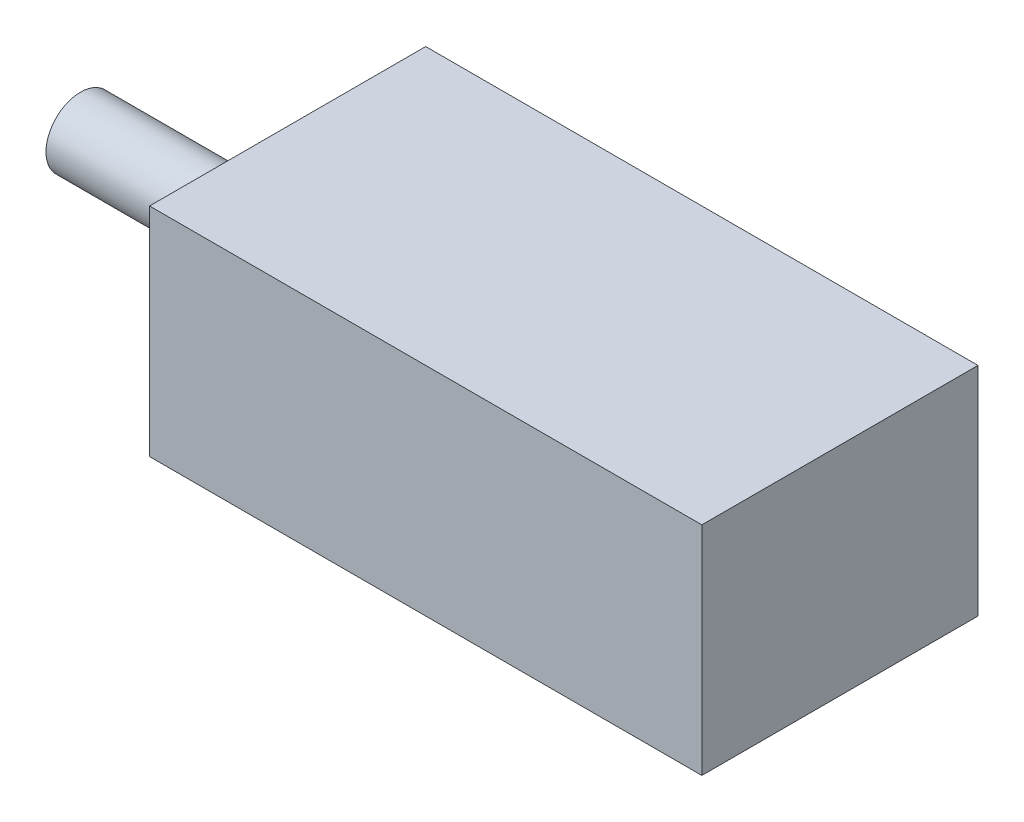
ISO-10303-21;
HEADER;
FILE_DESCRIPTION(('STEP AP214'),'2;1');
FILE_NAME('part.step','',(''),(''),'','','');
FILE_SCHEMA(('AUTOMOTIVE_DESIGN { 1 0 10303 214 1 1 1 1 }'));
ENDSEC;
DATA;
#1=APPLICATION_CONTEXT('core data for automotive mechanical design processes');
#2=APPLICATION_PROTOCOL_DEFINITION('international standard','automotive_design',2000,#1);
#3=PRODUCT_CONTEXT('',#1,'mechanical');
#4=PRODUCT('Part','Part','',(#3));
#5=PRODUCT_RELATED_PRODUCT_CATEGORY('part','',(#4));
#6=PRODUCT_DEFINITION_FORMATION('','',#4);
#7=PRODUCT_DEFINITION_CONTEXT('part definition',#1,'design');
#8=PRODUCT_DEFINITION('design','',#6,#7);
#9=PRODUCT_DEFINITION_SHAPE('','',#8);
#10=(LENGTH_UNIT() NAMED_UNIT(*) SI_UNIT(.MILLI.,.METRE.));
#11=(NAMED_UNIT(*) PLANE_ANGLE_UNIT() SI_UNIT($,.RADIAN.));
#12=(NAMED_UNIT(*) SI_UNIT($,.STERADIAN.) SOLID_ANGLE_UNIT());
#13=UNCERTAINTY_MEASURE_WITH_UNIT(LENGTH_MEASURE(1.E-05),#10,'distance_accuracy_value','');
#14=(GEOMETRIC_REPRESENTATION_CONTEXT(3) GLOBAL_UNCERTAINTY_ASSIGNED_CONTEXT((#13)) GLOBAL_UNIT_ASSIGNED_CONTEXT((#10,
#11,#12)) REPRESENTATION_CONTEXT('',''));
#15=CARTESIAN_POINT('',(0.,0.,0.));
#16=DIRECTION('',(0.,0.,1.));
#17=DIRECTION('',(1.,0.,0.));
#18=AXIS2_PLACEMENT_3D('',#15,#16,#17);
#19=CARTESIAN_POINT('',(0.,9.9822,0.));
#20=DIRECTION('',(1.,0.,0.));
#21=DIRECTION('',(0.,0.,-1.));
#22=AXIS2_PLACEMENT_3D('',#19,#20,#21);
#23=PLANE('',#22);
#24=CARTESIAN_POINT('',(0.,4.9911,-6.35));
#25=DIRECTION('',(1.,0.,0.));
#26=DIRECTION('',(0.,0.,-1.));
#27=AXIS2_PLACEMENT_3D('',#24,#25,#26);
#28=CIRCLE('',#27,1.5875);
#29=CARTESIAN_POINT('',(0.,4.9911,-7.9375));
#30=VERTEX_POINT('',#29);
#31=EDGE_CURVE('E11',#30,#30,#28,.F.);
#32=ORIENTED_EDGE('',*,*,#31,.F.);
#33=EDGE_LOOP('',(#32));
#34=FACE_BOUND('',#33,.T.);
#35=DIRECTION('',(0.,0.,1.));
#36=VECTOR('',#35,1.);
#37=CARTESIAN_POINT('',(0.,0.,0.));
#38=LINE('',#37,#36);
#39=CARTESIAN_POINT('',(0.,0.,-12.7));
#40=VERTEX_POINT('',#39);
#41=CARTESIAN_POINT('',(0.,0.,0.));
#42=VERTEX_POINT('',#41);
#43=EDGE_CURVE('E99',#40,#42,#38,.T.);
#44=ORIENTED_EDGE('',*,*,#43,.T.);
#45=DIRECTION('',(0.,-1.,0.));
#46=VECTOR('',#45,1.);
#47=CARTESIAN_POINT('',(0.,9.9822,0.));
#48=LINE('',#47,#46);
#49=CARTESIAN_POINT('',(0.,9.9822,0.));
#50=VERTEX_POINT('',#49);
#51=EDGE_CURVE('E41',#50,#42,#48,.T.);
#52=ORIENTED_EDGE('',*,*,#51,.F.);
#53=DIRECTION('',(0.,0.,1.));
#54=VECTOR('',#53,1.);
#55=CARTESIAN_POINT('',(0.,9.9822,0.));
#56=LINE('',#55,#54);
#57=CARTESIAN_POINT('',(0.,9.9822,-12.7));
#58=VERTEX_POINT('',#57);
#59=EDGE_CURVE('E85',#58,#50,#56,.T.);
#60=ORIENTED_EDGE('',*,*,#59,.F.);
#61=DIRECTION('',(0.,-1.,0.));
#62=VECTOR('',#61,1.);
#63=CARTESIAN_POINT('',(0.,9.9822,-12.7));
#64=LINE('',#63,#62);
#65=EDGE_CURVE('E95',#58,#40,#64,.T.);
#66=ORIENTED_EDGE('',*,*,#65,.T.);
#67=EDGE_LOOP('',(#44,#52,#60,#66));
#68=FACE_BOUND('',#67,.T.);
#69=ADVANCED_FACE('F33',(#34,#68),#23,.F.);
#70=CARTESIAN_POINT('',(0.,9.9822,0.));
#71=DIRECTION('',(0.,0.,-1.));
#72=DIRECTION('',(-1.,0.,0.));
#73=AXIS2_PLACEMENT_3D('',#70,#71,#72);
#74=PLANE('',#73);
#75=DIRECTION('',(1.,0.,0.));
#76=VECTOR('',#75,1.);
#77=CARTESIAN_POINT('',(0.,0.,0.));
#78=LINE('',#77,#76);
#79=CARTESIAN_POINT('',(25.4,0.,0.));
#80=VERTEX_POINT('',#79);
#81=EDGE_CURVE('E90',#42,#80,#78,.T.);
#82=ORIENTED_EDGE('',*,*,#81,.T.);
#83=DIRECTION('',(0.,-1.,0.));
#84=VECTOR('',#83,1.);
#85=CARTESIAN_POINT('',(25.4,9.9822,0.));
#86=LINE('',#85,#84);
#87=CARTESIAN_POINT('',(25.4,9.9822,0.));
#88=VERTEX_POINT('',#87);
#89=EDGE_CURVE('E88',#88,#80,#86,.T.);
#90=ORIENTED_EDGE('',*,*,#89,.F.);
#91=DIRECTION('',(1.,0.,0.));
#92=VECTOR('',#91,1.);
#93=CARTESIAN_POINT('',(0.,9.9822,0.));
#94=LINE('',#93,#92);
#95=EDGE_CURVE('E80',#50,#88,#94,.T.);
#96=ORIENTED_EDGE('',*,*,#95,.F.);
#97=ORIENTED_EDGE('',*,*,#51,.T.);
#98=EDGE_LOOP('',(#82,#90,#96,#97));
#99=FACE_BOUND('',#98,.T.);
#100=ADVANCED_FACE('F89',(#99),#74,.F.);
#101=CARTESIAN_POINT('',(25.4,9.9822,0.));
#102=DIRECTION('',(-1.,0.,0.));
#103=DIRECTION('',(0.,0.,1.));
#104=AXIS2_PLACEMENT_3D('',#101,#102,#103);
#105=PLANE('',#104);
#106=DIRECTION('',(0.,0.,-1.));
#107=VECTOR('',#106,1.);
#108=CARTESIAN_POINT('',(25.4,0.,0.));
#109=LINE('',#108,#107);
#110=CARTESIAN_POINT('',(25.4,0.,-12.7));
#111=VERTEX_POINT('',#110);
#112=EDGE_CURVE('E66',#80,#111,#109,.T.);
#113=ORIENTED_EDGE('',*,*,#112,.T.);
#114=DIRECTION('',(0.,-1.,0.));
#115=VECTOR('',#114,1.);
#116=CARTESIAN_POINT('',(25.4,9.9822,-12.7));
#117=LINE('',#116,#115);
#118=CARTESIAN_POINT('',(25.4,9.9822,-12.7));
#119=VERTEX_POINT('',#118);
#120=EDGE_CURVE('E91',#119,#111,#117,.T.);
#121=ORIENTED_EDGE('',*,*,#120,.F.);
#122=DIRECTION('',(0.,0.,-1.));
#123=VECTOR('',#122,1.);
#124=CARTESIAN_POINT('',(25.4,9.9822,0.));
#125=LINE('',#124,#123);
#126=EDGE_CURVE('E83',#88,#119,#125,.T.);
#127=ORIENTED_EDGE('',*,*,#126,.F.);
#128=ORIENTED_EDGE('',*,*,#89,.T.);
#129=EDGE_LOOP('',(#113,#121,#127,#128));
#130=FACE_BOUND('',#129,.T.);
#131=ADVANCED_FACE('F93',(#130),#105,.F.);
#132=CARTESIAN_POINT('',(0.,9.9822,-12.7));
#133=DIRECTION('',(0.,0.,1.));
#134=DIRECTION('',(1.,0.,0.));
#135=AXIS2_PLACEMENT_3D('',#132,#133,#134);
#136=PLANE('',#135);
#137=DIRECTION('',(-1.,0.,0.));
#138=VECTOR('',#137,1.);
#139=CARTESIAN_POINT('',(0.,0.,-12.7));
#140=LINE('',#139,#138);
#141=EDGE_CURVE('E72',#111,#40,#140,.T.);
#142=ORIENTED_EDGE('',*,*,#141,.T.);
#143=ORIENTED_EDGE('',*,*,#65,.F.);
#144=DIRECTION('',(-1.,0.,0.));
#145=VECTOR('',#144,1.);
#146=CARTESIAN_POINT('',(0.,9.9822,-12.7));
#147=LINE('',#146,#145);
#148=EDGE_CURVE('E49',#119,#58,#147,.T.);
#149=ORIENTED_EDGE('',*,*,#148,.F.);
#150=ORIENTED_EDGE('',*,*,#120,.T.);
#151=EDGE_LOOP('',(#142,#143,#149,#150));
#152=FACE_BOUND('',#151,.T.);
#153=ADVANCED_FACE('F121',(#152),#136,.F.);
#154=CARTESIAN_POINT('',(0.,9.9822,0.));
#155=DIRECTION('',(0.,-1.,0.));
#156=DIRECTION('',(0.,0.,-1.));
#157=AXIS2_PLACEMENT_3D('',#154,#155,#156);
#158=PLANE('',#157);
#159=ORIENTED_EDGE('',*,*,#59,.T.);
#160=ORIENTED_EDGE('',*,*,#95,.T.);
#161=ORIENTED_EDGE('',*,*,#126,.T.);
#162=ORIENTED_EDGE('',*,*,#148,.T.);
#163=EDGE_LOOP('',(#159,#160,#161,#162));
#164=FACE_BOUND('',#163,.T.);
#165=ADVANCED_FACE('F81',(#164),#158,.F.);
#166=CARTESIAN_POINT('',(0.,0.,0.));
#167=DIRECTION('',(0.,-1.,0.));
#168=DIRECTION('',(0.,0.,-1.));
#169=AXIS2_PLACEMENT_3D('',#166,#167,#168);
#170=PLANE('',#169);
#171=ORIENTED_EDGE('',*,*,#43,.F.);
#172=ORIENTED_EDGE('',*,*,#141,.F.);
#173=ORIENTED_EDGE('',*,*,#112,.F.);
#174=ORIENTED_EDGE('',*,*,#81,.F.);
#175=EDGE_LOOP('',(#171,#172,#173,#174));
#176=FACE_BOUND('',#175,.T.);
#177=ADVANCED_FACE('F110',(#176),#170,.T.);
#178=CARTESIAN_POINT('',(-9.525,4.9911,-6.35));
#179=DIRECTION('',(1.,0.,0.));
#180=DIRECTION('',(0.,0.,-1.));
#181=AXIS2_PLACEMENT_3D('',#178,#179,#180);
#182=CYLINDRICAL_SURFACE('',#181,1.5875);
#183=CARTESIAN_POINT('',(-9.525,4.9911,-6.35));
#184=DIRECTION('',(-1.,0.,0.));
#185=DIRECTION('',(0.,0.,1.));
#186=AXIS2_PLACEMENT_3D('',#183,#184,#185);
#187=CIRCLE('',#186,1.5875);
#188=CARTESIAN_POINT('',(-9.525,4.9911,-4.7625));
#189=VERTEX_POINT('',#188);
#190=EDGE_CURVE('E102',#189,#189,#187,.T.);
#191=ORIENTED_EDGE('',*,*,#190,.F.);
#192=EDGE_LOOP('',(#191));
#193=FACE_BOUND('',#192,.T.);
#194=ORIENTED_EDGE('',*,*,#31,.T.);
#195=EDGE_LOOP('',(#194));
#196=FACE_BOUND('',#195,.T.);
#197=ADVANCED_FACE('F112',(#193,#196),#182,.T.);
#198=CARTESIAN_POINT('',(-9.525,4.9911,-6.35));
#199=DIRECTION('',(-1.,0.,0.));
#200=DIRECTION('',(0.,0.,1.));
#201=AXIS2_PLACEMENT_3D('',#198,#199,#200);
#202=PLANE('',#201);
#203=ORIENTED_EDGE('',*,*,#190,.T.);
#204=EDGE_LOOP('',(#203));
#205=FACE_BOUND('',#204,.T.);
#206=ADVANCED_FACE('F118',(#205),#202,.T.);
#207=CLOSED_SHELL('',(#69,#100,#131,#153,#165,#177,#197,#206));
#208=MANIFOLD_SOLID_BREP('B2',#207);
#209=ADVANCED_BREP_SHAPE_REPRESENTATION('',(#18,#208),#14);
#210=SHAPE_DEFINITION_REPRESENTATION(#9,#209);
ENDSEC;
END-ISO-10303-21;
